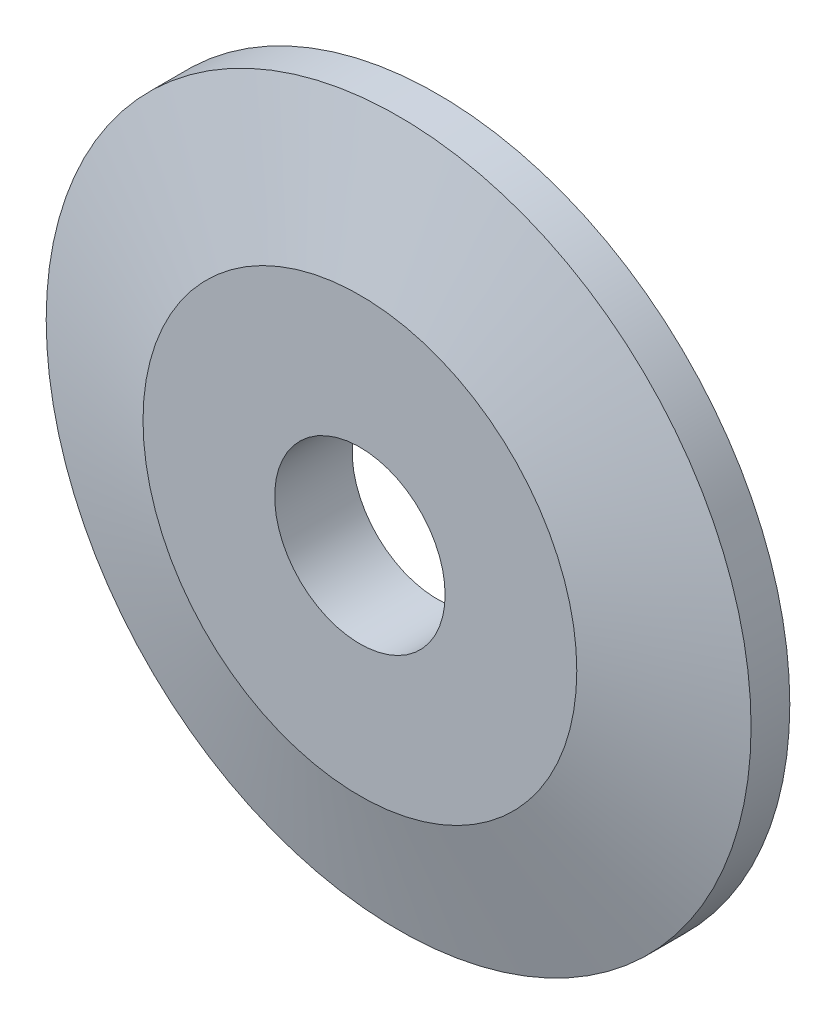
ISO-10303-21;
HEADER;
FILE_DESCRIPTION(('STEP AP214'),'2;1');
FILE_NAME('part.step','',(''),(''),'','','');
FILE_SCHEMA(('AUTOMOTIVE_DESIGN { 1 0 10303 214 1 1 1 1 }'));
ENDSEC;
DATA;
#1=APPLICATION_CONTEXT('core data for automotive mechanical design processes');
#2=APPLICATION_PROTOCOL_DEFINITION('international standard','automotive_design',2000,#1);
#3=PRODUCT_CONTEXT('',#1,'mechanical');
#4=PRODUCT('Part','Part','',(#3));
#5=PRODUCT_RELATED_PRODUCT_CATEGORY('part','',(#4));
#6=PRODUCT_DEFINITION_FORMATION('','',#4);
#7=PRODUCT_DEFINITION_CONTEXT('part definition',#1,'design');
#8=PRODUCT_DEFINITION('design','',#6,#7);
#9=PRODUCT_DEFINITION_SHAPE('','',#8);
#10=(LENGTH_UNIT() NAMED_UNIT(*) SI_UNIT(.MILLI.,.METRE.));
#11=(NAMED_UNIT(*) PLANE_ANGLE_UNIT() SI_UNIT($,.RADIAN.));
#12=(NAMED_UNIT(*) SI_UNIT($,.STERADIAN.) SOLID_ANGLE_UNIT());
#13=UNCERTAINTY_MEASURE_WITH_UNIT(LENGTH_MEASURE(1.E-05),#10,'distance_accuracy_value','');
#14=(GEOMETRIC_REPRESENTATION_CONTEXT(3) GLOBAL_UNCERTAINTY_ASSIGNED_CONTEXT((#13)) GLOBAL_UNIT_ASSIGNED_CONTEXT((#10,
#11,#12)) REPRESENTATION_CONTEXT('',''));
#15=CARTESIAN_POINT('',(0.,0.,0.));
#16=DIRECTION('',(0.,0.,1.));
#17=DIRECTION('',(1.,0.,0.));
#18=AXIS2_PLACEMENT_3D('',#15,#16,#17);
#19=CARTESIAN_POINT('',(0.,0.,23.5125));
#20=DIRECTION('',(0.,0.,-1.));
#21=DIRECTION('',(-1.,0.,0.));
#22=AXIS2_PLACEMENT_3D('',#19,#20,#21);
#23=PLANE('',#22);
#24=CARTESIAN_POINT('',(0.,19.55,23.5125));
#25=DIRECTION('',(0.,0.,1.));
#26=DIRECTION('',(1.,0.,0.));
#27=AXIS2_PLACEMENT_3D('',#24,#25,#26);
#28=CIRCLE('',#27,1.09999999999999);
#29=CARTESIAN_POINT('',(1.09999999999999,19.55,23.5125));
#30=VERTEX_POINT('',#29);
#31=EDGE_CURVE('E52',#30,#30,#28,.T.);
#32=ORIENTED_EDGE('',*,*,#31,.T.);
#33=EDGE_LOOP('',(#32));
#34=FACE_BOUND('',#33,.T.);
#35=CARTESIAN_POINT('',(0.,19.55,23.5125));
#36=DIRECTION('',(0.,0.,1.));
#37=DIRECTION('',(1.,0.,0.));
#38=AXIS2_PLACEMENT_3D('',#35,#36,#37);
#39=CIRCLE('',#38,4.55);
#40=CARTESIAN_POINT('',(4.55,19.55,23.5125));
#41=VERTEX_POINT('',#40);
#42=EDGE_CURVE('E10',#41,#41,#39,.T.);
#43=ORIENTED_EDGE('',*,*,#42,.F.);
#44=EDGE_LOOP('',(#43));
#45=FACE_BOUND('',#44,.T.);
#46=ADVANCED_FACE('F33',(#34,#45),#23,.T.);
#47=CARTESIAN_POINT('',(0.,19.55,33.45));
#48=DIRECTION('',(0.,0.,1.));
#49=DIRECTION('',(1.,0.,0.));
#50=AXIS2_PLACEMENT_3D('',#47,#48,#49);
#51=CYLINDRICAL_SURFACE('',#50,4.55);
#52=ORIENTED_EDGE('',*,*,#42,.T.);
#53=EDGE_LOOP('',(#52));
#54=FACE_BOUND('',#53,.T.);
#55=CARTESIAN_POINT('',(0.,19.55,24.0125));
#56=DIRECTION('',(0.,0.,1.));
#57=DIRECTION('',(1.,0.,0.));
#58=AXIS2_PLACEMENT_3D('',#55,#56,#57);
#59=CIRCLE('',#58,4.55);
#60=CARTESIAN_POINT('',(4.55,19.55,24.0125));
#61=VERTEX_POINT('',#60);
#62=EDGE_CURVE('E39',#61,#61,#59,.T.);
#63=ORIENTED_EDGE('',*,*,#62,.F.);
#64=EDGE_LOOP('',(#63));
#65=FACE_BOUND('',#64,.T.);
#66=ADVANCED_FACE('F72',(#54,#65),#51,.T.);
#67=CARTESIAN_POINT('',(0.,19.55,24.5125));
#68=DIRECTION('',(0.,0.,-1.));
#69=DIRECTION('',(-1.,0.,0.));
#70=AXIS2_PLACEMENT_3D('',#67,#68,#69);
#71=CONICAL_SURFACE('',#70,2.8,1.29249666778979);
#72=ORIENTED_EDGE('',*,*,#62,.T.);
#73=EDGE_LOOP('',(#72));
#74=FACE_BOUND('',#73,.T.);
#75=CARTESIAN_POINT('',(0.,19.55,24.5125));
#76=DIRECTION('',(0.,0.,1.));
#77=DIRECTION('',(1.,0.,0.));
#78=AXIS2_PLACEMENT_3D('',#75,#76,#77);
#79=CIRCLE('',#78,2.8);
#80=CARTESIAN_POINT('',(2.8,19.55,24.5125));
#81=VERTEX_POINT('',#80);
#82=EDGE_CURVE('E43',#81,#81,#79,.T.);
#83=ORIENTED_EDGE('',*,*,#82,.F.);
#84=EDGE_LOOP('',(#83));
#85=FACE_BOUND('',#84,.T.);
#86=ADVANCED_FACE('F67',(#74,#85),#71,.T.);
#87=CARTESIAN_POINT('',(0.,0.,24.5125));
#88=DIRECTION('',(0.,0.,-1.));
#89=DIRECTION('',(-1.,0.,0.));
#90=AXIS2_PLACEMENT_3D('',#87,#88,#89);
#91=PLANE('',#90);
#92=CARTESIAN_POINT('',(0.,19.55,24.5125));
#93=DIRECTION('',(0.,0.,1.));
#94=DIRECTION('',(1.,0.,0.));
#95=AXIS2_PLACEMENT_3D('',#92,#93,#94);
#96=CIRCLE('',#95,1.09999999999999);
#97=CARTESIAN_POINT('',(1.09999999999999,19.55,24.5125));
#98=VERTEX_POINT('',#97);
#99=EDGE_CURVE('E47',#98,#98,#96,.T.);
#100=ORIENTED_EDGE('',*,*,#99,.F.);
#101=EDGE_LOOP('',(#100));
#102=FACE_BOUND('',#101,.T.);
#103=ORIENTED_EDGE('',*,*,#82,.T.);
#104=EDGE_LOOP('',(#103));
#105=FACE_BOUND('',#104,.T.);
#106=ADVANCED_FACE('F61',(#102,#105),#91,.F.);
#107=CARTESIAN_POINT('',(0.,19.55,33.45));
#108=DIRECTION('',(0.,0.,1.));
#109=DIRECTION('',(1.,0.,0.));
#110=AXIS2_PLACEMENT_3D('',#107,#108,#109);
#111=CYLINDRICAL_SURFACE('',#110,1.09999999999999);
#112=ORIENTED_EDGE('',*,*,#31,.F.);
#113=EDGE_LOOP('',(#112));
#114=FACE_BOUND('',#113,.T.);
#115=ORIENTED_EDGE('',*,*,#99,.T.);
#116=EDGE_LOOP('',(#115));
#117=FACE_BOUND('',#116,.T.);
#118=ADVANCED_FACE('F58',(#114,#117),#111,.F.);
#119=CLOSED_SHELL('',(#46,#66,#86,#106,#118));
#120=MANIFOLD_SOLID_BREP('B2',#119);
#121=ADVANCED_BREP_SHAPE_REPRESENTATION('',(#18,#120),#14);
#122=SHAPE_DEFINITION_REPRESENTATION(#9,#121);
ENDSEC;
END-ISO-10303-21;
